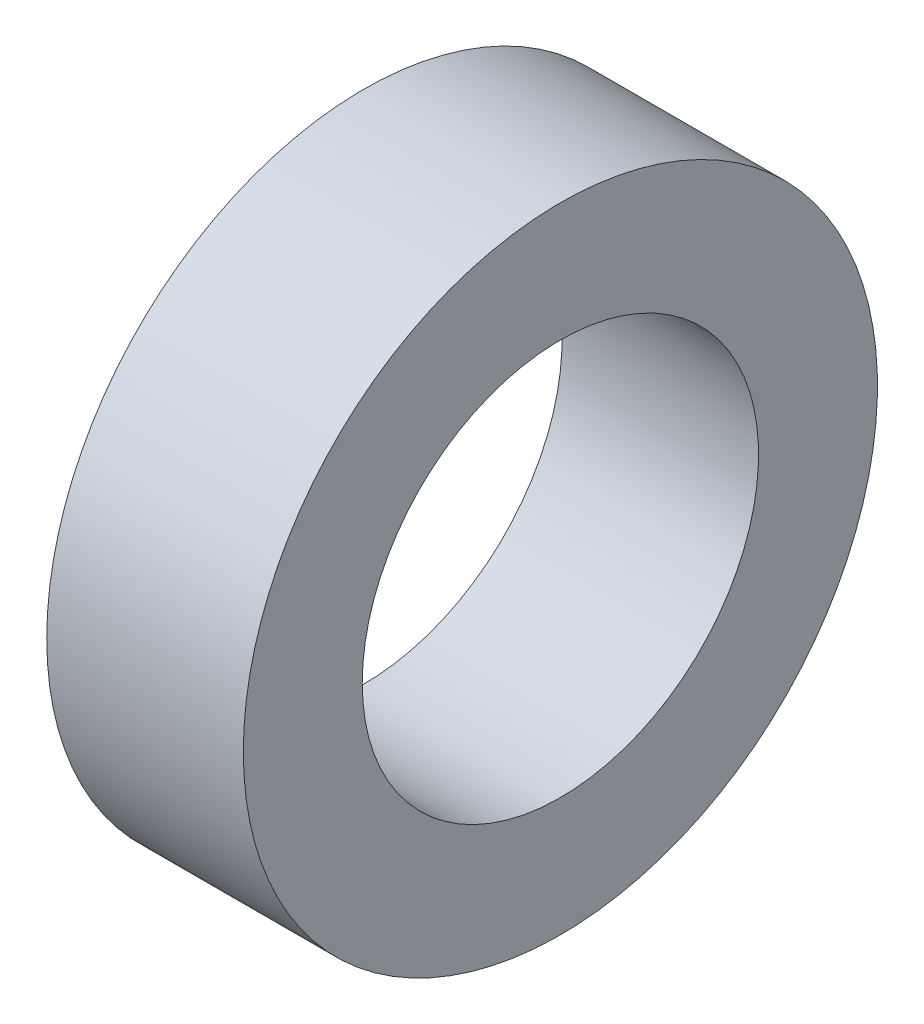
ISO-10303-21;
HEADER;
FILE_DESCRIPTION(('STEP AP214'),'2;1');
FILE_NAME('part.step','',(''),(''),'','','');
FILE_SCHEMA(('AUTOMOTIVE_DESIGN { 1 0 10303 214 1 1 1 1 }'));
ENDSEC;
DATA;
#1=APPLICATION_CONTEXT('core data for automotive mechanical design processes');
#2=APPLICATION_PROTOCOL_DEFINITION('international standard','automotive_design',2000,#1);
#3=PRODUCT_CONTEXT('',#1,'mechanical');
#4=PRODUCT('Part','Part','',(#3));
#5=PRODUCT_RELATED_PRODUCT_CATEGORY('part','',(#4));
#6=PRODUCT_DEFINITION_FORMATION('','',#4);
#7=PRODUCT_DEFINITION_CONTEXT('part definition',#1,'design');
#8=PRODUCT_DEFINITION('design','',#6,#7);
#9=PRODUCT_DEFINITION_SHAPE('','',#8);
#10=(LENGTH_UNIT() NAMED_UNIT(*) SI_UNIT(.MILLI.,.METRE.));
#11=(NAMED_UNIT(*) PLANE_ANGLE_UNIT() SI_UNIT($,.RADIAN.));
#12=(NAMED_UNIT(*) SI_UNIT($,.STERADIAN.) SOLID_ANGLE_UNIT());
#13=UNCERTAINTY_MEASURE_WITH_UNIT(LENGTH_MEASURE(1.E-05),#10,'distance_accuracy_value','');
#14=(GEOMETRIC_REPRESENTATION_CONTEXT(3) GLOBAL_UNCERTAINTY_ASSIGNED_CONTEXT((#13)) GLOBAL_UNIT_ASSIGNED_CONTEXT((#10,
#11,#12)) REPRESENTATION_CONTEXT('',''));
#15=CARTESIAN_POINT('',(0.,0.,0.));
#16=DIRECTION('',(0.,0.,1.));
#17=DIRECTION('',(1.,0.,0.));
#18=AXIS2_PLACEMENT_3D('',#15,#16,#17);
#19=CARTESIAN_POINT('',(16.119799866,2.499999953,0.));
#20=DIRECTION('',(-1.,0.,0.));
#21=DIRECTION('',(0.,0.,1.));
#22=AXIS2_PLACEMENT_3D('',#19,#20,#21);
#23=PLANE('',#22);
#24=CARTESIAN_POINT('',(16.119799866,0.,0.));
#25=DIRECTION('',(-1.,0.,0.));
#26=DIRECTION('',(0.,0.,1.));
#27=AXIS2_PLACEMENT_3D('',#24,#25,#26);
#28=CIRCLE('',#27,4.000000001);
#29=CARTESIAN_POINT('',(16.119799866,0.,4.000000001));
#30=VERTEX_POINT('',#29);
#31=EDGE_CURVE('E49',#30,#30,#28,.T.);
#32=ORIENTED_EDGE('',*,*,#31,.F.);
#33=EDGE_LOOP('',(#32));
#34=FACE_BOUND('',#33,.T.);
#35=CARTESIAN_POINT('',(16.119799866,0.,0.));
#36=DIRECTION('',(-1.,0.,0.));
#37=DIRECTION('',(0.,0.,1.));
#38=AXIS2_PLACEMENT_3D('',#35,#36,#37);
#39=CIRCLE('',#38,2.499999953);
#40=CARTESIAN_POINT('',(16.119799866,0.,2.499999953));
#41=VERTEX_POINT('',#40);
#42=EDGE_CURVE('E10',#41,#41,#39,.T.);
#43=ORIENTED_EDGE('',*,*,#42,.T.);
#44=EDGE_LOOP('',(#43));
#45=FACE_BOUND('',#44,.T.);
#46=ADVANCED_FACE('F35',(#34,#45),#23,.F.);
#47=CARTESIAN_POINT('',(0.,0.,0.));
#48=DIRECTION('',(-1.,0.,0.));
#49=DIRECTION('',(0.,0.,1.));
#50=AXIS2_PLACEMENT_3D('',#47,#48,#49);
#51=CYLINDRICAL_SURFACE('',#50,2.499999953);
#52=ORIENTED_EDGE('',*,*,#42,.F.);
#53=EDGE_LOOP('',(#52));
#54=FACE_BOUND('',#53,.T.);
#55=CARTESIAN_POINT('',(13.639799746,0.,0.));
#56=DIRECTION('',(-1.,0.,0.));
#57=DIRECTION('',(0.,0.,1.));
#58=AXIS2_PLACEMENT_3D('',#55,#56,#57);
#59=CIRCLE('',#58,2.499999953);
#60=CARTESIAN_POINT('',(13.639799746,0.,2.499999953));
#61=VERTEX_POINT('',#60);
#62=EDGE_CURVE('E41',#61,#61,#59,.T.);
#63=ORIENTED_EDGE('',*,*,#62,.T.);
#64=EDGE_LOOP('',(#63));
#65=FACE_BOUND('',#64,.T.);
#66=ADVANCED_FACE('F58',(#54,#65),#51,.F.);
#67=CARTESIAN_POINT('',(13.639799746,2.499999953,0.));
#68=DIRECTION('',(1.,0.,0.));
#69=DIRECTION('',(0.,0.,-1.));
#70=AXIS2_PLACEMENT_3D('',#67,#68,#69);
#71=PLANE('',#70);
#72=ORIENTED_EDGE('',*,*,#62,.F.);
#73=EDGE_LOOP('',(#72));
#74=FACE_BOUND('',#73,.T.);
#75=CARTESIAN_POINT('',(13.639799746,0.,0.));
#76=DIRECTION('',(-1.,0.,0.));
#77=DIRECTION('',(0.,0.,1.));
#78=AXIS2_PLACEMENT_3D('',#75,#76,#77);
#79=CIRCLE('',#78,4.000000001);
#80=CARTESIAN_POINT('',(13.639799746,0.,4.000000001));
#81=VERTEX_POINT('',#80);
#82=EDGE_CURVE('E45',#81,#81,#79,.T.);
#83=ORIENTED_EDGE('',*,*,#82,.T.);
#84=EDGE_LOOP('',(#83));
#85=FACE_BOUND('',#84,.T.);
#86=ADVANCED_FACE('F62',(#74,#85),#71,.F.);
#87=CARTESIAN_POINT('',(0.,0.,0.));
#88=DIRECTION('',(-1.,0.,0.));
#89=DIRECTION('',(0.,0.,1.));
#90=AXIS2_PLACEMENT_3D('',#87,#88,#89);
#91=CYLINDRICAL_SURFACE('',#90,4.000000001);
#92=ORIENTED_EDGE('',*,*,#82,.F.);
#93=EDGE_LOOP('',(#92));
#94=FACE_BOUND('',#93,.T.);
#95=ORIENTED_EDGE('',*,*,#31,.T.);
#96=EDGE_LOOP('',(#95));
#97=FACE_BOUND('',#96,.T.);
#98=ADVANCED_FACE('F55',(#94,#97),#91,.T.);
#99=CLOSED_SHELL('',(#46,#66,#86,#98));
#100=MANIFOLD_SOLID_BREP('B2',#99);
#101=ADVANCED_BREP_SHAPE_REPRESENTATION('',(#18,#100),#14);
#102=SHAPE_DEFINITION_REPRESENTATION(#9,#101);
ENDSEC;
END-ISO-10303-21;
